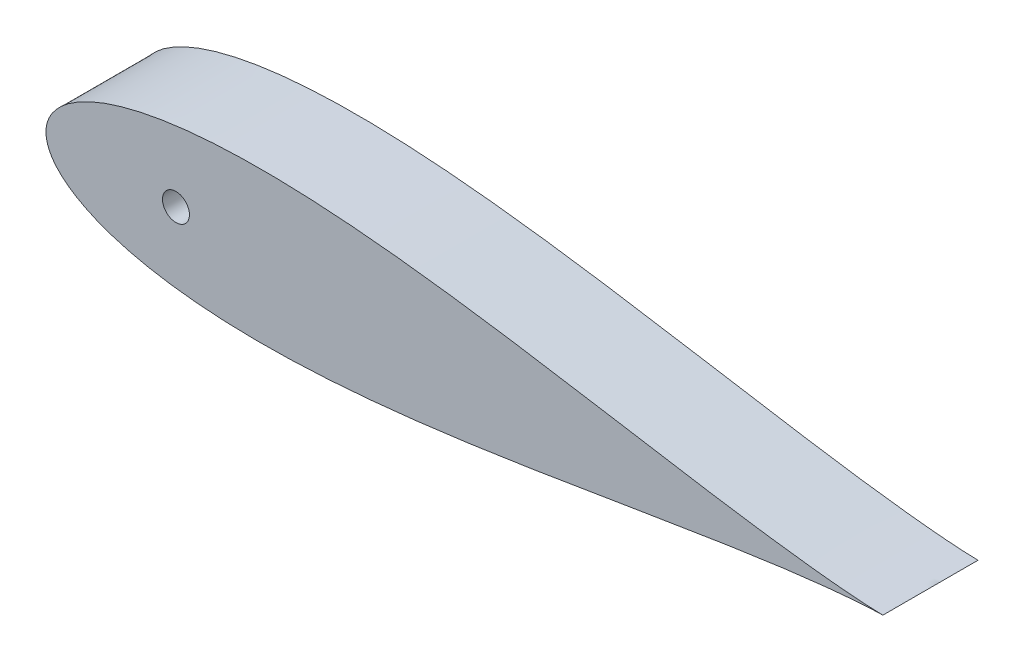
ISO-10303-21;
HEADER;
FILE_DESCRIPTION(('STEP AP214'),'2;1');
FILE_NAME('part.step','',(''),(''),'','','');
FILE_SCHEMA(('AUTOMOTIVE_DESIGN { 1 0 10303 214 1 1 1 1 }'));
ENDSEC;
DATA;
#1=APPLICATION_CONTEXT('core data for automotive mechanical design processes');
#2=APPLICATION_PROTOCOL_DEFINITION('international standard','automotive_design',2000,#1);
#3=PRODUCT_CONTEXT('',#1,'mechanical');
#4=PRODUCT('Part','Part','',(#3));
#5=PRODUCT_RELATED_PRODUCT_CATEGORY('part','',(#4));
#6=PRODUCT_DEFINITION_FORMATION('','',#4);
#7=PRODUCT_DEFINITION_CONTEXT('part definition',#1,'design');
#8=PRODUCT_DEFINITION('design','',#6,#7);
#9=PRODUCT_DEFINITION_SHAPE('','',#8);
#10=(LENGTH_UNIT() NAMED_UNIT(*) SI_UNIT(.MILLI.,.METRE.));
#11=(NAMED_UNIT(*) PLANE_ANGLE_UNIT() SI_UNIT($,.RADIAN.));
#12=(NAMED_UNIT(*) SI_UNIT($,.STERADIAN.) SOLID_ANGLE_UNIT());
#13=UNCERTAINTY_MEASURE_WITH_UNIT(LENGTH_MEASURE(1.E-05),#10,'distance_accuracy_value','');
#14=(GEOMETRIC_REPRESENTATION_CONTEXT(3) GLOBAL_UNCERTAINTY_ASSIGNED_CONTEXT((#13)) GLOBAL_UNIT_ASSIGNED_CONTEXT((#10,
#11,#12)) REPRESENTATION_CONTEXT('',''));
#15=CARTESIAN_POINT('',(0.,0.,0.));
#16=DIRECTION('',(0.,0.,1.));
#17=DIRECTION('',(1.,0.,0.));
#18=AXIS2_PLACEMENT_3D('',#15,#16,#17);
#19=CARTESIAN_POINT('',(670.56,0.,76.2));
#20=CARTESIAN_POINT('',(670.56,0.0156785949268131,76.2));
#21=CARTESIAN_POINT('',(666.344759682885,0.0546967077380254,76.2));
#22=CARTESIAN_POINT('',(662.850933167967,0.234427605388554,76.2));
#23=CARTESIAN_POINT('',(656.504964310749,0.543558382914671,76.2));
#24=CARTESIAN_POINT('',(649.292951764021,1.03477125279464,76.2));
#25=CARTESIAN_POINT('',(640.49155963975,1.73191957841822,76.2));
#26=CARTESIAN_POINT('',(630.413817461935,2.6633854932203,76.2));
#27=CARTESIAN_POINT('',(619.014124193102,3.84925366408521,76.2));
#28=CARTESIAN_POINT('',(606.37498851238,5.30442898343123,76.2));
#29=CARTESIAN_POINT('',(592.543922516217,7.03763490710039,76.2));
#30=CARTESIAN_POINT('',(577.585454095337,9.05063614704163,76.2));
#31=CARTESIAN_POINT('',(561.564270734499,11.338919624911,76.2));
#32=CARTESIAN_POINT('',(544.549749945783,13.8906653749143,76.2));
#33=CARTESIAN_POINT('',(526.614143657614,16.687720752969,76.2));
#34=CARTESIAN_POINT('',(507.832591566438,19.705111662944,76.2));
#35=CARTESIAN_POINT('',(488.28271028846,22.9116726009051,76.2));
#36=CARTESIAN_POINT('',(468.04436773457,26.2704360601485,76.2));
#37=CARTESIAN_POINT('',(447.199424328287,29.7390074319526,76.2));
#38=CARTESIAN_POINT('',(425.831595832134,33.2703241206413,76.2));
#39=CARTESIAN_POINT('',(404.026315660115,36.8132205450789,76.2));
#40=CARTESIAN_POINT('',(381.870662855574,40.3132668564462,76.2));
#41=CARTESIAN_POINT('',(359.45331489519,43.7135025323023,76.2));
#42=CARTESIAN_POINT('',(336.864544150043,46.9554474567625,76.2));
#43=CARTESIAN_POINT('',(314.196207315012,49.9798438951445,76.2));
#44=CARTESIAN_POINT('',(291.541767703989,52.7277127038914,76.2));
#45=CARTESIAN_POINT('',(268.996310773138,55.1412010116265,76.2));
#46=CARTESIAN_POINT('',(246.656558649997,57.164603828805,76.2));
#47=CARTESIAN_POINT('',(224.620860897201,58.7451766411797,76.2));
#48=CARTESIAN_POINT('',(202.989192599403,59.8341217002378,76.2));
#49=CARTESIAN_POINT('',(181.863132616042,60.38750614212,76.2));
#50=CARTESIAN_POINT('',(161.345829026568,60.3669613241372,76.2));
#51=CARTESIAN_POINT('',(141.542033827972,59.7398958243377,76.2));
#52=CARTESIAN_POINT('',(122.558104572902,58.4817581038394,76.2));
#53=CARTESIAN_POINT('',(104.502313427195,56.5743039322433,76.2));
#54=CARTESIAN_POINT('',(87.4850186361547,54.0089351991654,76.2));
#55=CARTESIAN_POINT('',(71.6196960831899,50.7847520029957,76.2));
#56=CARTESIAN_POINT('',(57.0237097246999,46.9125430655859,76.2));
#57=CARTESIAN_POINT('',(43.8204543300276,42.4150024601016,76.2));
#58=CARTESIAN_POINT('',(32.1416452388822,37.3322040286461,76.2));
#59=CARTESIAN_POINT('',(22.1291073753192,31.7314553388245,76.2));
#60=CARTESIAN_POINT('',(13.9324235239131,25.7264121059535,76.2));
#61=CARTESIAN_POINT('',(7.6896164890983,19.5132076319135,76.2));
#62=CARTESIAN_POINT('',(3.46313634309125,13.420354420661,76.2));
#63=CARTESIAN_POINT('',(1.10633322756685,7.92338943472272,76.2));
#64=CARTESIAN_POINT('',(0.15461158157361,3.51379661507287,76.2));
#65=CARTESIAN_POINT('',(-0.0621515976067641,1.5591281566194E-13,76.2));
#66=CARTESIAN_POINT('',(0.154611581573626,-3.51379661507311,76.2));
#67=CARTESIAN_POINT('',(1.10633322756686,-7.92338943472269,76.2));
#68=CARTESIAN_POINT('',(3.46313634309125,-13.420354420661,76.2));
#69=CARTESIAN_POINT('',(7.68961648909825,-19.5132076319134,76.2));
#70=CARTESIAN_POINT('',(13.9324235239131,-25.7264121059535,76.2));
#71=CARTESIAN_POINT('',(22.1291073753193,-31.7314553388245,76.2));
#72=CARTESIAN_POINT('',(32.1416452388821,-37.3322040286461,76.2));
#73=CARTESIAN_POINT('',(43.8204543300276,-42.4150024601017,76.2));
#74=CARTESIAN_POINT('',(57.0237097246998,-46.9125430655859,76.2));
#75=CARTESIAN_POINT('',(71.6196960831899,-50.7847520029958,76.2));
#76=CARTESIAN_POINT('',(87.4850186361546,-54.0089351991654,76.2));
#77=CARTESIAN_POINT('',(104.502313427195,-56.5743039322434,76.2));
#78=CARTESIAN_POINT('',(122.558104572901,-58.4817581038394,76.2));
#79=CARTESIAN_POINT('',(141.542033827972,-59.7398958243377,76.2));
#80=CARTESIAN_POINT('',(161.345829026568,-60.3669613241371,76.2));
#81=CARTESIAN_POINT('',(181.863132616042,-60.38750614212,76.2));
#82=CARTESIAN_POINT('',(202.989192599403,-59.8341217002379,76.2));
#83=CARTESIAN_POINT('',(224.620860897201,-58.7451766411797,76.2));
#84=CARTESIAN_POINT('',(246.656558649997,-57.164603828805,76.2));
#85=CARTESIAN_POINT('',(268.996310773138,-55.1412010116265,76.2));
#86=CARTESIAN_POINT('',(291.541767703989,-52.7277127038914,76.2));
#87=CARTESIAN_POINT('',(314.196207315012,-49.9798438951445,76.2));
#88=CARTESIAN_POINT('',(336.864544150043,-46.9554474567625,76.2));
#89=CARTESIAN_POINT('',(359.45331489519,-43.7135025323023,76.2));
#90=CARTESIAN_POINT('',(381.870662855574,-40.3132668564462,76.2));
#91=CARTESIAN_POINT('',(404.026315660115,-36.8132205450789,76.2));
#92=CARTESIAN_POINT('',(425.831595832134,-33.2703241206413,76.2));
#93=CARTESIAN_POINT('',(447.199424328287,-29.7390074319526,76.2));
#94=CARTESIAN_POINT('',(468.04436773457,-26.2704360601485,76.2));
#95=CARTESIAN_POINT('',(488.28271028846,-22.911672600905,76.2));
#96=CARTESIAN_POINT('',(507.832591566438,-19.7051116629441,76.2));
#97=CARTESIAN_POINT('',(526.614143657614,-16.687720752969,76.2));
#98=CARTESIAN_POINT('',(544.549749945782,-13.8906653749143,76.2));
#99=CARTESIAN_POINT('',(561.564270734499,-11.338919624911,76.2));
#100=CARTESIAN_POINT('',(577.585454095337,-9.05063614704163,76.2));
#101=CARTESIAN_POINT('',(592.543922516217,-7.03763490710038,76.2));
#102=CARTESIAN_POINT('',(606.37498851238,-5.30442898343123,76.2));
#103=CARTESIAN_POINT('',(619.014124193101,-3.84925366408522,76.2));
#104=CARTESIAN_POINT('',(630.413817461935,-2.6633854932203,76.2));
#105=CARTESIAN_POINT('',(640.491559639751,-1.73191957841821,76.2));
#106=CARTESIAN_POINT('',(649.29295176402,-1.03477125279464,76.2));
#107=CARTESIAN_POINT('',(656.504964310749,-0.543558382914674,76.2));
#108=CARTESIAN_POINT('',(662.850933167967,-0.23442760538855,76.2));
#109=CARTESIAN_POINT('',(666.344759682885,-0.0546967077380269,76.2));
#110=CARTESIAN_POINT('',(670.56,-0.0156785949268135,76.2));
#111=CARTESIAN_POINT('',(670.56,0.,76.2));
#112=B_SPLINE_CURVE_WITH_KNOTS('',3,(#19,#20,#21,#22,#23,#24,#25,#26,#27,#28,#29,#30,#31,#32,
#33,#34,#35,#36,#37,#38,#39,#40,#41,#42,#43,#44,#45,#46,#47,#48,#49,#50,#51,#52,#53,#54,#55,#56,
#57,#58,#59,#60,#61,#62,#63,#64,#65,#66,#67,#68,#69,#70,#71,#72,#73,#74,#75,#76,#77,#78,#79,#80,
#81,#82,#83,#84,#85,#86,#87,#88,#89,#90,#91,#92,#93,#94,#95,#96,#97,#98,#99,#100,#101,#102,#103,
#104,#105,#106,#107,#108,#109,#110,#111),.UNSPECIFIED.,.T.,.F.,(4,1,1,1,1,1,1,1,1,1,1,1,1,1,1,1,
1,1,1,1,1,1,1,1,1,1,1,1,1,1,1,1,1,1,1,1,1,1,1,1,1,1,1,1,1,1,1,1,1,1,1,1,1,1,1,1,1,1,1,1,1,1,1,1,
1,1,1,1,1,1,1,1,1,1,1,1,1,1,1,1,1,1,1,1,1,1,1,1,1,1,4),(0.,0.00216777795588342,
0.00539478220000884,0.00966720698444134,0.0149667883303173,0.0212708876900959,
0.0285525550130683,0.0367806836725549,0.0459201019032637,0.0559317636633187,0.0667728836144854,
0.0783971303496518,0.0907548266908363,0.103793164577546,0.117456431914319,0.131686225652521,
0.146421738497113,0.161599998000845,0.177156132626574,0.193023668070302,0.209134785631037,
0.225420632511523,0.241811601924249,0.258237646860869,0.274628556698349,0.290914287398014,
0.307025228908797,0.322892517177238,0.33844834182358,0.353626206573582,0.368361231970712,
0.382590427827798,0.396252960572084,0.40929041186716,0.421647009590256,0.433269881487031,
0.444109248914041,0.454118639688981,0.463255054987312,0.471479113777303,0.478755288570903,
0.485052318112802,0.490344025694165,0.494609832614287,0.497833231437255,0.5,0.502166768562745,
0.505390167385713,0.509655974305835,0.514947681887198,0.521244711429097,0.528520886222697,
0.536744945012688,0.545881360311019,0.555890751085959,0.566730118512969,0.578352990409744,
0.59070958813284,0.603747039427916,0.617409572172202,0.631638768029288,0.646373793426418,
0.66155165817642,0.677107482822761,0.692974771091203,0.709085712601986,0.725371443301651,
0.741762353139131,0.758188398075751,0.774579367488477,0.790865214368963,0.806976331929698,
0.822843867373426,0.838400001999155,0.853578261502887,0.868313774347479,0.882543568085681,
0.896206835422454,0.909245173309164,0.921602869650348,0.933227116385514,0.944068236336681,
0.954079898096736,0.963219316327445,0.971447444986932,0.978729112309904,0.985033211669683,
0.990332793015559,0.994605217799991,0.997832222044117,1.),.UNSPECIFIED.);
#113=DIRECTION('',(0.,0.,-1.));
#114=VECTOR('',#113,1.);
#115=SURFACE_OF_LINEAR_EXTRUSION('',#112,#114);
#116=CARTESIAN_POINT('',(670.56,0.,76.2));
#117=VERTEX_POINT('',#116);
#118=EDGE_CURVE('E10',#117,#117,#112,.T.);
#119=ORIENTED_EDGE('',*,*,#118,.F.);
#120=EDGE_LOOP('',(#119));
#121=FACE_BOUND('',#120,.T.);
#122=CARTESIAN_POINT('',(670.56,0.,0.));
#123=CARTESIAN_POINT('',(670.56,0.0156785949268131,0.));
#124=CARTESIAN_POINT('',(666.344759682885,0.0546967077380254,0.));
#125=CARTESIAN_POINT('',(662.850933167967,0.234427605388554,0.));
#126=CARTESIAN_POINT('',(656.504964310749,0.543558382914671,0.));
#127=CARTESIAN_POINT('',(649.292951764021,1.03477125279464,0.));
#128=CARTESIAN_POINT('',(640.49155963975,1.73191957841822,0.));
#129=CARTESIAN_POINT('',(630.413817461935,2.6633854932203,0.));
#130=CARTESIAN_POINT('',(619.014124193102,3.84925366408521,0.));
#131=CARTESIAN_POINT('',(606.37498851238,5.30442898343123,0.));
#132=CARTESIAN_POINT('',(592.543922516217,7.03763490710039,0.));
#133=CARTESIAN_POINT('',(577.585454095337,9.05063614704163,0.));
#134=CARTESIAN_POINT('',(561.564270734499,11.338919624911,0.));
#135=CARTESIAN_POINT('',(544.549749945783,13.8906653749143,0.));
#136=CARTESIAN_POINT('',(526.614143657614,16.687720752969,0.));
#137=CARTESIAN_POINT('',(507.832591566438,19.705111662944,0.));
#138=CARTESIAN_POINT('',(488.28271028846,22.9116726009051,0.));
#139=CARTESIAN_POINT('',(468.04436773457,26.2704360601485,0.));
#140=CARTESIAN_POINT('',(447.199424328287,29.7390074319526,0.));
#141=CARTESIAN_POINT('',(425.831595832134,33.2703241206413,0.));
#142=CARTESIAN_POINT('',(404.026315660115,36.8132205450789,0.));
#143=CARTESIAN_POINT('',(381.870662855574,40.3132668564462,0.));
#144=CARTESIAN_POINT('',(359.45331489519,43.7135025323023,0.));
#145=CARTESIAN_POINT('',(336.864544150043,46.9554474567625,0.));
#146=CARTESIAN_POINT('',(314.196207315012,49.9798438951445,0.));
#147=CARTESIAN_POINT('',(291.541767703989,52.7277127038914,0.));
#148=CARTESIAN_POINT('',(268.996310773138,55.1412010116265,0.));
#149=CARTESIAN_POINT('',(246.656558649997,57.164603828805,0.));
#150=CARTESIAN_POINT('',(224.620860897201,58.7451766411797,0.));
#151=CARTESIAN_POINT('',(202.989192599403,59.8341217002378,0.));
#152=CARTESIAN_POINT('',(181.863132616042,60.38750614212,0.));
#153=CARTESIAN_POINT('',(161.345829026568,60.3669613241372,0.));
#154=CARTESIAN_POINT('',(141.542033827972,59.7398958243377,0.));
#155=CARTESIAN_POINT('',(122.558104572902,58.4817581038394,0.));
#156=CARTESIAN_POINT('',(104.502313427195,56.5743039322433,0.));
#157=CARTESIAN_POINT('',(87.4850186361547,54.0089351991654,0.));
#158=CARTESIAN_POINT('',(71.6196960831899,50.7847520029957,0.));
#159=CARTESIAN_POINT('',(57.0237097246999,46.9125430655859,0.));
#160=CARTESIAN_POINT('',(43.8204543300276,42.4150024601016,0.));
#161=CARTESIAN_POINT('',(32.1416452388822,37.3322040286461,0.));
#162=CARTESIAN_POINT('',(22.1291073753192,31.7314553388245,0.));
#163=CARTESIAN_POINT('',(13.9324235239131,25.7264121059535,0.));
#164=CARTESIAN_POINT('',(7.6896164890983,19.5132076319135,0.));
#165=CARTESIAN_POINT('',(3.46313634309125,13.420354420661,0.));
#166=CARTESIAN_POINT('',(1.10633322756685,7.92338943472272,0.));
#167=CARTESIAN_POINT('',(0.15461158157361,3.51379661507287,0.));
#168=CARTESIAN_POINT('',(-0.0621515976067641,1.5591281566194E-13,0.));
#169=CARTESIAN_POINT('',(0.154611581573626,-3.51379661507311,0.));
#170=CARTESIAN_POINT('',(1.10633322756686,-7.92338943472269,0.));
#171=CARTESIAN_POINT('',(3.46313634309125,-13.420354420661,0.));
#172=CARTESIAN_POINT('',(7.68961648909825,-19.5132076319134,0.));
#173=CARTESIAN_POINT('',(13.9324235239131,-25.7264121059535,0.));
#174=CARTESIAN_POINT('',(22.1291073753193,-31.7314553388245,0.));
#175=CARTESIAN_POINT('',(32.1416452388821,-37.3322040286461,0.));
#176=CARTESIAN_POINT('',(43.8204543300276,-42.4150024601017,0.));
#177=CARTESIAN_POINT('',(57.0237097246998,-46.9125430655859,0.));
#178=CARTESIAN_POINT('',(71.6196960831899,-50.7847520029958,0.));
#179=CARTESIAN_POINT('',(87.4850186361546,-54.0089351991654,0.));
#180=CARTESIAN_POINT('',(104.502313427195,-56.5743039322434,0.));
#181=CARTESIAN_POINT('',(122.558104572901,-58.4817581038394,0.));
#182=CARTESIAN_POINT('',(141.542033827972,-59.7398958243377,0.));
#183=CARTESIAN_POINT('',(161.345829026568,-60.3669613241371,0.));
#184=CARTESIAN_POINT('',(181.863132616042,-60.38750614212,0.));
#185=CARTESIAN_POINT('',(202.989192599403,-59.8341217002379,0.));
#186=CARTESIAN_POINT('',(224.620860897201,-58.7451766411797,0.));
#187=CARTESIAN_POINT('',(246.656558649997,-57.164603828805,0.));
#188=CARTESIAN_POINT('',(268.996310773138,-55.1412010116265,0.));
#189=CARTESIAN_POINT('',(291.541767703989,-52.7277127038914,0.));
#190=CARTESIAN_POINT('',(314.196207315012,-49.9798438951445,0.));
#191=CARTESIAN_POINT('',(336.864544150043,-46.9554474567625,0.));
#192=CARTESIAN_POINT('',(359.45331489519,-43.7135025323023,0.));
#193=CARTESIAN_POINT('',(381.870662855574,-40.3132668564462,0.));
#194=CARTESIAN_POINT('',(404.026315660115,-36.8132205450789,0.));
#195=CARTESIAN_POINT('',(425.831595832134,-33.2703241206413,0.));
#196=CARTESIAN_POINT('',(447.199424328287,-29.7390074319526,0.));
#197=CARTESIAN_POINT('',(468.04436773457,-26.2704360601485,0.));
#198=CARTESIAN_POINT('',(488.28271028846,-22.911672600905,0.));
#199=CARTESIAN_POINT('',(507.832591566438,-19.7051116629441,0.));
#200=CARTESIAN_POINT('',(526.614143657614,-16.687720752969,0.));
#201=CARTESIAN_POINT('',(544.549749945782,-13.8906653749143,0.));
#202=CARTESIAN_POINT('',(561.564270734499,-11.338919624911,0.));
#203=CARTESIAN_POINT('',(577.585454095337,-9.05063614704163,0.));
#204=CARTESIAN_POINT('',(592.543922516217,-7.03763490710038,0.));
#205=CARTESIAN_POINT('',(606.37498851238,-5.30442898343123,0.));
#206=CARTESIAN_POINT('',(619.014124193101,-3.84925366408522,0.));
#207=CARTESIAN_POINT('',(630.413817461935,-2.6633854932203,0.));
#208=CARTESIAN_POINT('',(640.491559639751,-1.73191957841821,0.));
#209=CARTESIAN_POINT('',(649.29295176402,-1.03477125279464,0.));
#210=CARTESIAN_POINT('',(656.504964310749,-0.543558382914674,0.));
#211=CARTESIAN_POINT('',(662.850933167967,-0.23442760538855,0.));
#212=CARTESIAN_POINT('',(666.344759682885,-0.0546967077380269,0.));
#213=CARTESIAN_POINT('',(670.56,-0.0156785949268135,0.));
#214=CARTESIAN_POINT('',(670.56,0.,0.));
#215=B_SPLINE_CURVE_WITH_KNOTS('',3,(#122,#123,#124,#125,#126,#127,#128,#129,#130,#131,#132,
#133,#134,#135,#136,#137,#138,#139,#140,#141,#142,#143,#144,#145,#146,#147,#148,#149,#150,#151,
#152,#153,#154,#155,#156,#157,#158,#159,#160,#161,#162,#163,#164,#165,#166,#167,#168,#169,#170,
#171,#172,#173,#174,#175,#176,#177,#178,#179,#180,#181,#182,#183,#184,#185,#186,#187,#188,#189,
#190,#191,#192,#193,#194,#195,#196,#197,#198,#199,#200,#201,#202,#203,#204,#205,#206,#207,#208,
#209,#210,#211,#212,#213,#214),.UNSPECIFIED.,.T.,.F.,(4,1,1,1,1,1,1,1,1,1,1,1,1,1,1,1,1,1,1,1,1,
1,1,1,1,1,1,1,1,1,1,1,1,1,1,1,1,1,1,1,1,1,1,1,1,1,1,1,1,1,1,1,1,1,1,1,1,1,1,1,1,1,1,1,1,1,1,1,1,
1,1,1,1,1,1,1,1,1,1,1,1,1,1,1,1,1,1,1,1,1,4),(0.,0.00216777795588342,0.00539478220000884,
0.00966720698444134,0.0149667883303173,0.0212708876900959,0.0285525550130683,0.0367806836725549,
0.0459201019032637,0.0559317636633187,0.0667728836144854,0.0783971303496518,0.0907548266908363,
0.103793164577546,0.117456431914319,0.131686225652521,0.146421738497113,0.161599998000845,
0.177156132626574,0.193023668070302,0.209134785631037,0.225420632511523,0.241811601924249,
0.258237646860869,0.274628556698349,0.290914287398014,0.307025228908797,0.322892517177238,
0.33844834182358,0.353626206573582,0.368361231970712,0.382590427827798,0.396252960572084,
0.40929041186716,0.421647009590256,0.433269881487031,0.444109248914041,0.454118639688981,
0.463255054987312,0.471479113777303,0.478755288570903,0.485052318112802,0.490344025694165,
0.494609832614287,0.497833231437255,0.5,0.502166768562745,0.505390167385713,0.509655974305835,
0.514947681887198,0.521244711429097,0.528520886222697,0.536744945012688,0.545881360311019,
0.555890751085959,0.566730118512969,0.578352990409744,0.59070958813284,0.603747039427916,
0.617409572172202,0.631638768029288,0.646373793426418,0.66155165817642,0.677107482822761,
0.692974771091203,0.709085712601986,0.725371443301651,0.741762353139131,0.758188398075751,
0.774579367488477,0.790865214368963,0.806976331929698,0.822843867373426,0.838400001999155,
0.853578261502887,0.868313774347479,0.882543568085681,0.896206835422454,0.909245173309164,
0.921602869650348,0.933227116385514,0.944068236336681,0.954079898096736,0.963219316327445,
0.971447444986932,0.978729112309904,0.985033211669683,0.990332793015559,0.994605217799991,
0.997832222044117,1.),.UNSPECIFIED.);
#216=CARTESIAN_POINT('',(670.56,0.,0.));
#217=VERTEX_POINT('',#216);
#218=EDGE_CURVE('E35',#217,#217,#215,.T.);
#219=ORIENTED_EDGE('',*,*,#218,.T.);
#220=EDGE_LOOP('',(#219));
#221=FACE_BOUND('',#220,.T.);
#222=ADVANCED_FACE('F31',(#121,#221),#115,.F.);
#223=CARTESIAN_POINT('',(0.,1.54838793559665E-13,76.2));
#224=DIRECTION('',(0.,0.,-1.));
#225=DIRECTION('',(-1.,0.,0.));
#226=AXIS2_PLACEMENT_3D('',#223,#224,#225);
#227=PLANE('',#226);
#228=CARTESIAN_POINT('',(104.139232412,0.,76.2));
#229=DIRECTION('',(0.,0.,1.));
#230=DIRECTION('',(1.,0.,0.));
#231=AXIS2_PLACEMENT_3D('',#228,#229,#230);
#232=CIRCLE('',#231,10.795);
#233=CARTESIAN_POINT('',(114.934232412,0.,76.2));
#234=VERTEX_POINT('',#233);
#235=EDGE_CURVE('E48',#234,#234,#232,.T.);
#236=ORIENTED_EDGE('',*,*,#235,.F.);
#237=EDGE_LOOP('',(#236));
#238=FACE_BOUND('',#237,.T.);
#239=ORIENTED_EDGE('',*,*,#118,.T.);
#240=EDGE_LOOP('',(#239));
#241=FACE_BOUND('',#240,.T.);
#242=ADVANCED_FACE('F66',(#238,#241),#227,.F.);
#243=CARTESIAN_POINT('',(0.,1.54838793559665E-13,0.));
#244=DIRECTION('',(0.,0.,-1.));
#245=DIRECTION('',(-1.,0.,0.));
#246=AXIS2_PLACEMENT_3D('',#243,#244,#245);
#247=PLANE('',#246);
#248=CARTESIAN_POINT('',(104.139232412,0.,0.));
#249=DIRECTION('',(0.,0.,1.));
#250=DIRECTION('',(1.,0.,0.));
#251=AXIS2_PLACEMENT_3D('',#248,#249,#250);
#252=CIRCLE('',#251,10.795);
#253=CARTESIAN_POINT('',(114.934232412,0.,0.));
#254=VERTEX_POINT('',#253);
#255=EDGE_CURVE('E43',#254,#254,#252,.T.);
#256=ORIENTED_EDGE('',*,*,#255,.T.);
#257=EDGE_LOOP('',(#256));
#258=FACE_BOUND('',#257,.T.);
#259=ORIENTED_EDGE('',*,*,#218,.F.);
#260=EDGE_LOOP('',(#259));
#261=FACE_BOUND('',#260,.T.);
#262=ADVANCED_FACE('F57',(#258,#261),#247,.T.);
#263=CARTESIAN_POINT('',(104.139232412,0.,0.));
#264=DIRECTION('',(0.,0.,1.));
#265=DIRECTION('',(1.,0.,0.));
#266=AXIS2_PLACEMENT_3D('',#263,#264,#265);
#267=CYLINDRICAL_SURFACE('',#266,10.795);
#268=ORIENTED_EDGE('',*,*,#255,.F.);
#269=EDGE_LOOP('',(#268));
#270=FACE_BOUND('',#269,.T.);
#271=ORIENTED_EDGE('',*,*,#235,.T.);
#272=EDGE_LOOP('',(#271));
#273=FACE_BOUND('',#272,.T.);
#274=ADVANCED_FACE('F60',(#270,#273),#267,.F.);
#275=CLOSED_SHELL('',(#222,#242,#262,#274));
#276=MANIFOLD_SOLID_BREP('B2',#275);
#277=ADVANCED_BREP_SHAPE_REPRESENTATION('',(#18,#276),#14);
#278=SHAPE_DEFINITION_REPRESENTATION(#9,#277);
ENDSEC;
END-ISO-10303-21;
